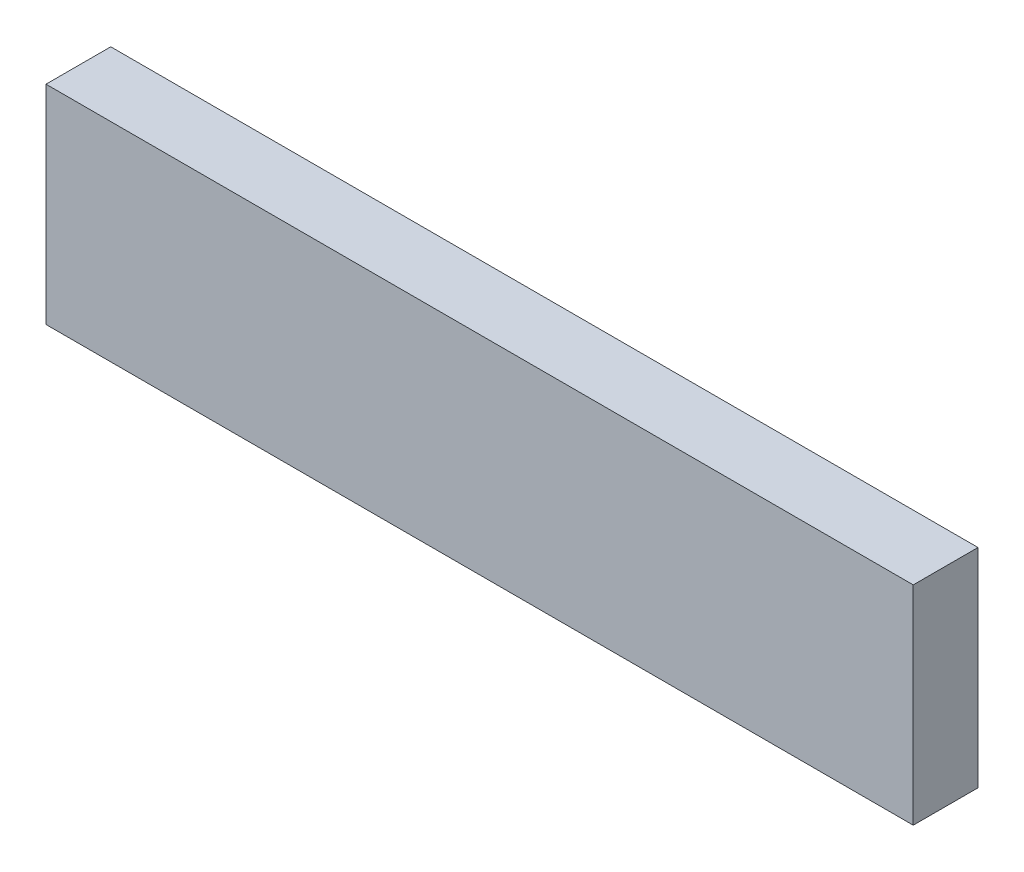
ISO-10303-21;
HEADER;
FILE_DESCRIPTION(('STEP AP214'),'2;1');
FILE_NAME('part.step','',(''),(''),'','','');
FILE_SCHEMA(('AUTOMOTIVE_DESIGN { 1 0 10303 214 1 1 1 1 }'));
ENDSEC;
DATA;
#1=APPLICATION_CONTEXT('core data for automotive mechanical design processes');
#2=APPLICATION_PROTOCOL_DEFINITION('international standard','automotive_design',2000,#1);
#3=PRODUCT_CONTEXT('',#1,'mechanical');
#4=PRODUCT('Part','Part','',(#3));
#5=PRODUCT_RELATED_PRODUCT_CATEGORY('part','',(#4));
#6=PRODUCT_DEFINITION_FORMATION('','',#4);
#7=PRODUCT_DEFINITION_CONTEXT('part definition',#1,'design');
#8=PRODUCT_DEFINITION('design','',#6,#7);
#9=PRODUCT_DEFINITION_SHAPE('','',#8);
#10=(LENGTH_UNIT() NAMED_UNIT(*) SI_UNIT(.MILLI.,.METRE.));
#11=(NAMED_UNIT(*) PLANE_ANGLE_UNIT() SI_UNIT($,.RADIAN.));
#12=(NAMED_UNIT(*) SI_UNIT($,.STERADIAN.) SOLID_ANGLE_UNIT());
#13=UNCERTAINTY_MEASURE_WITH_UNIT(LENGTH_MEASURE(1.E-05),#10,'distance_accuracy_value','');
#14=(GEOMETRIC_REPRESENTATION_CONTEXT(3) GLOBAL_UNCERTAINTY_ASSIGNED_CONTEXT((#13)) GLOBAL_UNIT_ASSIGNED_CONTEXT((#10,
#11,#12)) REPRESENTATION_CONTEXT('',''));
#15=CARTESIAN_POINT('',(0.,0.,0.));
#16=DIRECTION('',(0.,0.,1.));
#17=DIRECTION('',(1.,0.,0.));
#18=AXIS2_PLACEMENT_3D('',#15,#16,#17);
#19=CARTESIAN_POINT('',(-7.5,-9.362,-1.));
#20=DIRECTION('',(-1.,0.,0.));
#21=DIRECTION('',(0.,0.,1.));
#22=AXIS2_PLACEMENT_3D('',#19,#20,#21);
#23=PLANE('',#22);
#24=DIRECTION('',(0.,-1.,0.));
#25=VECTOR('',#24,1.);
#26=CARTESIAN_POINT('',(-7.5,-5.762,-1.));
#27=LINE('',#26,#25);
#28=CARTESIAN_POINT('',(-7.5,-5.762,-1.));
#29=VERTEX_POINT('',#28);
#30=CARTESIAN_POINT('',(-7.5,-9.362,-1.));
#31=VERTEX_POINT('',#30);
#32=EDGE_CURVE('E11',#29,#31,#27,.T.);
#33=ORIENTED_EDGE('',*,*,#32,.F.);
#34=DIRECTION('',(0.,0.,-1.));
#35=VECTOR('',#34,1.);
#36=CARTESIAN_POINT('',(-7.5,-5.762,-1.));
#37=LINE('',#36,#35);
#38=CARTESIAN_POINT('',(-7.5,-5.762,-2.12));
#39=VERTEX_POINT('',#38);
#40=EDGE_CURVE('E100',#29,#39,#37,.T.);
#41=ORIENTED_EDGE('',*,*,#40,.T.);
#42=DIRECTION('',(0.,1.,0.));
#43=VECTOR('',#42,1.);
#44=CARTESIAN_POINT('',(-7.5,-5.762,-2.12));
#45=LINE('',#44,#43);
#46=CARTESIAN_POINT('',(-7.5,-9.362,-2.12));
#47=VERTEX_POINT('',#46);
#48=EDGE_CURVE('E27',#47,#39,#45,.T.);
#49=ORIENTED_EDGE('',*,*,#48,.F.);
#50=DIRECTION('',(0.,0.,-1.));
#51=VECTOR('',#50,1.);
#52=CARTESIAN_POINT('',(-7.5,-9.362,-1.));
#53=LINE('',#52,#51);
#54=EDGE_CURVE('E76',#31,#47,#53,.T.);
#55=ORIENTED_EDGE('',*,*,#54,.F.);
#56=EDGE_LOOP('',(#33,#41,#49,#55));
#57=FACE_BOUND('',#56,.T.);
#58=ADVANCED_FACE('F16',(#57),#23,.T.);
#59=CARTESIAN_POINT('',(0.,-7.562,-1.));
#60=DIRECTION('',(0.,0.,1.));
#61=DIRECTION('',(1.,0.,0.));
#62=AXIS2_PLACEMENT_3D('',#59,#60,#61);
#63=PLANE('',#62);
#64=ORIENTED_EDGE('',*,*,#32,.T.);
#65=DIRECTION('',(1.,0.,0.));
#66=VECTOR('',#65,1.);
#67=CARTESIAN_POINT('',(-7.5,-9.362,-1.));
#68=LINE('',#67,#66);
#69=CARTESIAN_POINT('',(7.5,-9.362,-1.));
#70=VERTEX_POINT('',#69);
#71=EDGE_CURVE('E66',#31,#70,#68,.T.);
#72=ORIENTED_EDGE('',*,*,#71,.T.);
#73=DIRECTION('',(0.,1.,0.));
#74=VECTOR('',#73,1.);
#75=CARTESIAN_POINT('',(7.5,-9.362,-1.));
#76=LINE('',#75,#74);
#77=CARTESIAN_POINT('',(7.5,-5.762,-1.));
#78=VERTEX_POINT('',#77);
#79=EDGE_CURVE('E71',#70,#78,#76,.T.);
#80=ORIENTED_EDGE('',*,*,#79,.T.);
#81=DIRECTION('',(-1.,0.,0.));
#82=VECTOR('',#81,1.);
#83=CARTESIAN_POINT('',(7.5,-5.762,-1.));
#84=LINE('',#83,#82);
#85=EDGE_CURVE('E101',#78,#29,#84,.T.);
#86=ORIENTED_EDGE('',*,*,#85,.T.);
#87=EDGE_LOOP('',(#64,#72,#80,#86));
#88=FACE_BOUND('',#87,.T.);
#89=ADVANCED_FACE('F68',(#88),#63,.T.);
#90=CARTESIAN_POINT('',(0.,-7.562,-2.12));
#91=DIRECTION('',(0.,0.,-1.));
#92=DIRECTION('',(0.,-1.,0.));
#93=AXIS2_PLACEMENT_3D('',#90,#91,#92);
#94=PLANE('',#93);
#95=ORIENTED_EDGE('',*,*,#48,.T.);
#96=DIRECTION('',(1.,0.,0.));
#97=VECTOR('',#96,1.);
#98=CARTESIAN_POINT('',(7.5,-5.762,-2.12));
#99=LINE('',#98,#97);
#100=CARTESIAN_POINT('',(7.5,-5.762,-2.12));
#101=VERTEX_POINT('',#100);
#102=EDGE_CURVE('E99',#39,#101,#99,.T.);
#103=ORIENTED_EDGE('',*,*,#102,.T.);
#104=DIRECTION('',(0.,-1.,0.));
#105=VECTOR('',#104,1.);
#106=CARTESIAN_POINT('',(7.5,-9.362,-2.12));
#107=LINE('',#106,#105);
#108=CARTESIAN_POINT('',(7.5,-9.362,-2.12));
#109=VERTEX_POINT('',#108);
#110=EDGE_CURVE('E86',#101,#109,#107,.T.);
#111=ORIENTED_EDGE('',*,*,#110,.T.);
#112=DIRECTION('',(-1.,0.,0.));
#113=VECTOR('',#112,1.);
#114=CARTESIAN_POINT('',(-7.5,-9.362,-2.12));
#115=LINE('',#114,#113);
#116=EDGE_CURVE('E20',#109,#47,#115,.T.);
#117=ORIENTED_EDGE('',*,*,#116,.T.);
#118=EDGE_LOOP('',(#95,#103,#111,#117));
#119=FACE_BOUND('',#118,.T.);
#120=ADVANCED_FACE('F158',(#119),#94,.T.);
#121=CARTESIAN_POINT('',(-7.5,-5.762,-1.));
#122=DIRECTION('',(0.,1.,0.));
#123=DIRECTION('',(1.,0.,0.));
#124=AXIS2_PLACEMENT_3D('',#121,#122,#123);
#125=PLANE('',#124);
#126=ORIENTED_EDGE('',*,*,#85,.F.);
#127=DIRECTION('',(0.,0.,-1.));
#128=VECTOR('',#127,1.);
#129=CARTESIAN_POINT('',(7.5,-5.762,-1.));
#130=LINE('',#129,#128);
#131=EDGE_CURVE('E77',#78,#101,#130,.T.);
#132=ORIENTED_EDGE('',*,*,#131,.T.);
#133=ORIENTED_EDGE('',*,*,#102,.F.);
#134=ORIENTED_EDGE('',*,*,#40,.F.);
#135=EDGE_LOOP('',(#126,#132,#133,#134));
#136=FACE_BOUND('',#135,.T.);
#137=ADVANCED_FACE('F163',(#136),#125,.T.);
#138=CARTESIAN_POINT('',(7.5,-9.362,-1.));
#139=DIRECTION('',(0.,-1.,0.));
#140=DIRECTION('',(0.,0.,-1.));
#141=AXIS2_PLACEMENT_3D('',#138,#139,#140);
#142=PLANE('',#141);
#143=ORIENTED_EDGE('',*,*,#71,.F.);
#144=ORIENTED_EDGE('',*,*,#54,.T.);
#145=ORIENTED_EDGE('',*,*,#116,.F.);
#146=DIRECTION('',(0.,0.,-1.));
#147=VECTOR('',#146,1.);
#148=CARTESIAN_POINT('',(7.5,-9.362,-1.));
#149=LINE('',#148,#147);
#150=EDGE_CURVE('E80',#70,#109,#149,.T.);
#151=ORIENTED_EDGE('',*,*,#150,.F.);
#152=EDGE_LOOP('',(#143,#144,#145,#151));
#153=FACE_BOUND('',#152,.T.);
#154=ADVANCED_FACE('F81',(#153),#142,.T.);
#155=CARTESIAN_POINT('',(7.5,-5.762,-1.));
#156=DIRECTION('',(1.,0.,0.));
#157=DIRECTION('',(0.,1.,0.));
#158=AXIS2_PLACEMENT_3D('',#155,#156,#157);
#159=PLANE('',#158);
#160=ORIENTED_EDGE('',*,*,#79,.F.);
#161=ORIENTED_EDGE('',*,*,#150,.T.);
#162=ORIENTED_EDGE('',*,*,#110,.F.);
#163=ORIENTED_EDGE('',*,*,#131,.F.);
#164=EDGE_LOOP('',(#160,#161,#162,#163));
#165=FACE_BOUND('',#164,.T.);
#166=ADVANCED_FACE('F18',(#165),#159,.T.);
#167=CLOSED_SHELL('',(#58,#89,#120,#137,#154,#166));
#168=MANIFOLD_SOLID_BREP('B1',#167);
#169=ADVANCED_BREP_SHAPE_REPRESENTATION('',(#18,#168),#14);
#170=SHAPE_DEFINITION_REPRESENTATION(#9,#169);
ENDSEC;
END-ISO-10303-21;
